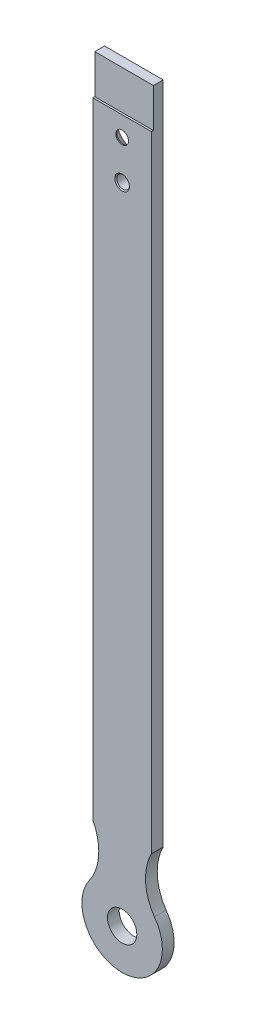
ISO-10303-21;
HEADER;
FILE_DESCRIPTION(('STEP AP214'),'2;1');
FILE_NAME('part.step','',(''),(''),'','','');
FILE_SCHEMA(('AUTOMOTIVE_DESIGN { 1 0 10303 214 1 1 1 1 }'));
ENDSEC;
DATA;
#1=APPLICATION_CONTEXT('core data for automotive mechanical design processes');
#2=APPLICATION_PROTOCOL_DEFINITION('international standard','automotive_design',2000,#1);
#3=PRODUCT_CONTEXT('',#1,'mechanical');
#4=PRODUCT('Part','Part','',(#3));
#5=PRODUCT_RELATED_PRODUCT_CATEGORY('part','',(#4));
#6=PRODUCT_DEFINITION_FORMATION('','',#4);
#7=PRODUCT_DEFINITION_CONTEXT('part definition',#1,'design');
#8=PRODUCT_DEFINITION('design','',#6,#7);
#9=PRODUCT_DEFINITION_SHAPE('','',#8);
#10=(LENGTH_UNIT() NAMED_UNIT(*) SI_UNIT(.MILLI.,.METRE.));
#11=(NAMED_UNIT(*) PLANE_ANGLE_UNIT() SI_UNIT($,.RADIAN.));
#12=(NAMED_UNIT(*) SI_UNIT($,.STERADIAN.) SOLID_ANGLE_UNIT());
#13=UNCERTAINTY_MEASURE_WITH_UNIT(LENGTH_MEASURE(1.E-05),#10,'distance_accuracy_value','');
#14=(GEOMETRIC_REPRESENTATION_CONTEXT(3) GLOBAL_UNCERTAINTY_ASSIGNED_CONTEXT((#13)) GLOBAL_UNIT_ASSIGNED_CONTEXT((#10,
#11,#12)) REPRESENTATION_CONTEXT('',''));
#15=CARTESIAN_POINT('',(0.,0.,0.));
#16=DIRECTION('',(0.,0.,1.));
#17=DIRECTION('',(1.,0.,0.));
#18=AXIS2_PLACEMENT_3D('',#15,#16,#17);
#19=CARTESIAN_POINT('',(38.582625391415,47.7587561776277,6.));
#20=DIRECTION('',(0.,0.,-1.));
#21=DIRECTION('',(-1.,0.,0.));
#22=AXIS2_PLACEMENT_3D('',#19,#20,#21);
#23=PLANE('',#22);
#24=CARTESIAN_POINT('',(0.,350.,6.));
#25=DIRECTION('',(0.,0.,-1.));
#26=DIRECTION('',(-1.,0.,0.));
#27=AXIS2_PLACEMENT_3D('',#24,#25,#26);
#28=CIRCLE('',#27,3.75000000000003);
#29=CARTESIAN_POINT('',(-3.75000000000004,350.,6.));
#30=VERTEX_POINT('',#29);
#31=EDGE_CURVE('E11',#30,#30,#28,.T.);
#32=ORIENTED_EDGE('',*,*,#31,.T.);
#33=EDGE_LOOP('',(#32));
#34=FACE_BOUND('',#33,.T.);
#35=DIRECTION('',(0.,1.,0.));
#36=VECTOR('',#35,1.);
#37=CARTESIAN_POINT('',(15.,60.1261643945457,6.));
#38=LINE('',#37,#36);
#39=CARTESIAN_POINT('',(15.,60.1261643945457,6.));
#40=VERTEX_POINT('',#39);
#41=CARTESIAN_POINT('',(15.,380.056352187278,6.));
#42=VERTEX_POINT('',#41);
#43=EDGE_CURVE('E127',#40,#42,#38,.T.);
#44=ORIENTED_EDGE('',*,*,#43,.T.);
#45=DIRECTION('',(-1.,0.,0.));
#46=VECTOR('',#45,1.);
#47=CARTESIAN_POINT('',(20.5785038712378,380.056352187278,6.));
#48=LINE('',#47,#46);
#49=CARTESIAN_POINT('',(-15.,380.056352187278,6.));
#50=VERTEX_POINT('',#49);
#51=EDGE_CURVE('E215',#42,#50,#48,.T.);
#52=ORIENTED_EDGE('',*,*,#51,.T.);
#53=DIRECTION('',(0.,-1.,0.));
#54=VECTOR('',#53,1.);
#55=CARTESIAN_POINT('',(-15.,60.1261643945457,6.));
#56=LINE('',#55,#54);
#57=CARTESIAN_POINT('',(-15.,60.1261643945457,6.));
#58=VERTEX_POINT('',#57);
#59=EDGE_CURVE('E94',#50,#58,#56,.T.);
#60=ORIENTED_EDGE('',*,*,#59,.T.);
#61=CARTESIAN_POINT('',(-38.582625391415,47.7587561776277,6.));
#62=DIRECTION('',(0.,0.,-1.));
#63=DIRECTION('',(1.,0.,0.));
#64=AXIS2_PLACEMENT_3D('',#61,#62,#63);
#65=CIRCLE('',#64,26.6288003176205);
#66=CARTESIAN_POINT('',(-16.5120693771721,32.8596433322979,6.));
#67=VERTEX_POINT('',#66);
#68=EDGE_CURVE('E198',#58,#67,#65,.T.);
#69=ORIENTED_EDGE('',*,*,#68,.T.);
#70=CARTESIAN_POINT('',(0.,20.5785038712379,6.));
#71=DIRECTION('',(0.,0.,1.));
#72=DIRECTION('',(1.,0.,0.));
#73=AXIS2_PLACEMENT_3D('',#70,#71,#72);
#74=CIRCLE('',#73,20.5785038712379);
#75=CARTESIAN_POINT('',(16.5120693771721,32.8596433322979,6.));
#76=VERTEX_POINT('',#75);
#77=EDGE_CURVE('E200',#67,#76,#74,.T.);
#78=ORIENTED_EDGE('',*,*,#77,.T.);
#79=CARTESIAN_POINT('',(38.582625391415,47.7587561776277,6.));
#80=DIRECTION('',(0.,0.,-1.));
#81=DIRECTION('',(-1.,0.,0.));
#82=AXIS2_PLACEMENT_3D('',#79,#80,#81);
#83=CIRCLE('',#82,26.6288003176205);
#84=EDGE_CURVE('E59',#76,#40,#83,.T.);
#85=ORIENTED_EDGE('',*,*,#84,.T.);
#86=EDGE_LOOP('',(#44,#52,#60,#69,#78,#85));
#87=FACE_BOUND('',#86,.T.);
#88=CARTESIAN_POINT('',(0.,20.5785038712379,6.));
#89=DIRECTION('',(0.,0.,1.));
#90=DIRECTION('',(1.,0.,0.));
#91=AXIS2_PLACEMENT_3D('',#88,#89,#90);
#92=CIRCLE('',#91,7.5);
#93=CARTESIAN_POINT('',(7.49999999999999,20.5785038712379,6.));
#94=VERTEX_POINT('',#93);
#95=EDGE_CURVE('E185',#94,#94,#92,.T.);
#96=ORIENTED_EDGE('',*,*,#95,.F.);
#97=EDGE_LOOP('',(#96));
#98=FACE_BOUND('',#97,.T.);
#99=CARTESIAN_POINT('',(0.,370.,6.));
#100=DIRECTION('',(0.,0.,1.));
#101=DIRECTION('',(1.,0.,0.));
#102=AXIS2_PLACEMENT_3D('',#99,#100,#101);
#103=CIRCLE('',#102,3.25);
#104=CARTESIAN_POINT('',(3.25,370.,6.));
#105=VERTEX_POINT('',#104);
#106=EDGE_CURVE('E360',#105,#105,#103,.T.);
#107=ORIENTED_EDGE('',*,*,#106,.F.);
#108=EDGE_LOOP('',(#107));
#109=FACE_BOUND('',#108,.T.);
#110=ADVANCED_FACE('F35',(#34,#87,#98,#109),#23,.F.);
#111=CARTESIAN_POINT('',(38.582625391415,47.7587561776277,0.));
#112=DIRECTION('',(0.,0.,-1.));
#113=DIRECTION('',(-1.,0.,0.));
#114=AXIS2_PLACEMENT_3D('',#111,#112,#113);
#115=PLANE('',#114);
#116=CARTESIAN_POINT('',(0.,350.,0.));
#117=DIRECTION('',(0.,0.,-1.));
#118=DIRECTION('',(-1.,0.,0.));
#119=AXIS2_PLACEMENT_3D('',#116,#117,#118);
#120=CIRCLE('',#119,3.74999999999998);
#121=CARTESIAN_POINT('',(-3.74999999999998,350.,0.));
#122=VERTEX_POINT('',#121);
#123=EDGE_CURVE('E153',#122,#122,#120,.F.);
#124=ORIENTED_EDGE('',*,*,#123,.T.);
#125=EDGE_LOOP('',(#124));
#126=FACE_BOUND('',#125,.T.);
#127=CARTESIAN_POINT('',(0.,370.,0.));
#128=DIRECTION('',(0.,0.,-1.));
#129=DIRECTION('',(-1.,0.,0.));
#130=AXIS2_PLACEMENT_3D('',#127,#128,#129);
#131=CIRCLE('',#130,8.74999999999998);
#132=CARTESIAN_POINT('',(-8.74999999999999,370.,0.));
#133=VERTEX_POINT('',#132);
#134=EDGE_CURVE('E147',#133,#133,#131,.F.);
#135=ORIENTED_EDGE('',*,*,#134,.T.);
#136=EDGE_LOOP('',(#135));
#137=FACE_BOUND('',#136,.T.);
#138=CARTESIAN_POINT('',(0.,20.5785038712379,0.));
#139=DIRECTION('',(0.,0.,1.));
#140=DIRECTION('',(1.,0.,0.));
#141=AXIS2_PLACEMENT_3D('',#138,#139,#140);
#142=CIRCLE('',#141,7.5);
#143=CARTESIAN_POINT('',(7.49999999999999,20.5785038712379,0.));
#144=VERTEX_POINT('',#143);
#145=EDGE_CURVE('E179',#144,#144,#142,.T.);
#146=ORIENTED_EDGE('',*,*,#145,.T.);
#147=EDGE_LOOP('',(#146));
#148=FACE_BOUND('',#147,.T.);
#149=DIRECTION('',(0.,-1.,0.));
#150=VECTOR('',#149,1.);
#151=CARTESIAN_POINT('',(-15.,60.1261643945457,0.));
#152=LINE('',#151,#150);
#153=CARTESIAN_POINT('',(-15.,400.,0.));
#154=VERTEX_POINT('',#153);
#155=CARTESIAN_POINT('',(-15.,60.1261643945457,0.));
#156=VERTEX_POINT('',#155);
#157=EDGE_CURVE('E180',#154,#156,#152,.T.);
#158=ORIENTED_EDGE('',*,*,#157,.F.);
#159=DIRECTION('',(-1.,0.,0.));
#160=VECTOR('',#159,1.);
#161=CARTESIAN_POINT('',(15.,400.,0.));
#162=LINE('',#161,#160);
#163=CARTESIAN_POINT('',(15.,400.,0.));
#164=VERTEX_POINT('',#163);
#165=EDGE_CURVE('E124',#164,#154,#162,.T.);
#166=ORIENTED_EDGE('',*,*,#165,.F.);
#167=DIRECTION('',(0.,1.,0.));
#168=VECTOR('',#167,1.);
#169=CARTESIAN_POINT('',(15.,60.1261643945457,0.));
#170=LINE('',#169,#168);
#171=CARTESIAN_POINT('',(15.,60.1261643945457,0.));
#172=VERTEX_POINT('',#171);
#173=EDGE_CURVE('E195',#172,#164,#170,.T.);
#174=ORIENTED_EDGE('',*,*,#173,.F.);
#175=CARTESIAN_POINT('',(38.582625391415,47.7587561776277,0.));
#176=DIRECTION('',(0.,0.,-1.));
#177=DIRECTION('',(-1.,0.,0.));
#178=AXIS2_PLACEMENT_3D('',#175,#176,#177);
#179=CIRCLE('',#178,26.6288003176205);
#180=CARTESIAN_POINT('',(16.5120693771721,32.8596433322979,0.));
#181=VERTEX_POINT('',#180);
#182=EDGE_CURVE('E194',#181,#172,#179,.T.);
#183=ORIENTED_EDGE('',*,*,#182,.F.);
#184=CARTESIAN_POINT('',(0.,20.5785038712379,0.));
#185=DIRECTION('',(0.,0.,1.));
#186=DIRECTION('',(1.,0.,0.));
#187=AXIS2_PLACEMENT_3D('',#184,#185,#186);
#188=CIRCLE('',#187,20.5785038712379);
#189=CARTESIAN_POINT('',(-16.5120693771721,32.8596433322979,0.));
#190=VERTEX_POINT('',#189);
#191=EDGE_CURVE('E187',#190,#181,#188,.T.);
#192=ORIENTED_EDGE('',*,*,#191,.F.);
#193=CARTESIAN_POINT('',(-38.582625391415,47.7587561776277,0.));
#194=DIRECTION('',(0.,0.,-1.));
#195=DIRECTION('',(1.,0.,0.));
#196=AXIS2_PLACEMENT_3D('',#193,#194,#195);
#197=CIRCLE('',#196,26.6288003176205);
#198=EDGE_CURVE('E183',#156,#190,#197,.T.);
#199=ORIENTED_EDGE('',*,*,#198,.F.);
#200=EDGE_LOOP('',(#158,#166,#174,#183,#192,#199));
#201=FACE_BOUND('',#200,.T.);
#202=ADVANCED_FACE('F170',(#126,#137,#148,#201),#115,.T.);
#203=CARTESIAN_POINT('',(-15.,60.1261643945457,6.));
#204=DIRECTION('',(1.,0.,0.));
#205=DIRECTION('',(0.,1.,0.));
#206=AXIS2_PLACEMENT_3D('',#203,#204,#205);
#207=PLANE('',#206);
#208=ORIENTED_EDGE('',*,*,#59,.F.);
#209=DIRECTION('',(0.,0.,1.));
#210=VECTOR('',#209,1.);
#211=CARTESIAN_POINT('',(-15.,380.056352187278,5.));
#212=LINE('',#211,#210);
#213=CARTESIAN_POINT('',(-15.,380.056352187278,5.));
#214=VERTEX_POINT('',#213);
#215=EDGE_CURVE('E120',#214,#50,#212,.T.);
#216=ORIENTED_EDGE('',*,*,#215,.F.);
#217=DIRECTION('',(0.,-1.,0.));
#218=VECTOR('',#217,1.);
#219=CARTESIAN_POINT('',(-15.,400.,5.));
#220=LINE('',#219,#218);
#221=CARTESIAN_POINT('',(-15.,400.,5.));
#222=VERTEX_POINT('',#221);
#223=EDGE_CURVE('E112',#222,#214,#220,.T.);
#224=ORIENTED_EDGE('',*,*,#223,.F.);
#225=DIRECTION('',(0.,0.,-1.));
#226=VECTOR('',#225,1.);
#227=CARTESIAN_POINT('',(-15.,400.,6.));
#228=LINE('',#227,#226);
#229=EDGE_CURVE('E87',#222,#154,#228,.T.);
#230=ORIENTED_EDGE('',*,*,#229,.T.);
#231=ORIENTED_EDGE('',*,*,#157,.T.);
#232=DIRECTION('',(0.,0.,-1.));
#233=VECTOR('',#232,1.);
#234=CARTESIAN_POINT('',(-15.,60.1261643945457,6.));
#235=LINE('',#234,#233);
#236=EDGE_CURVE('E117',#58,#156,#235,.T.);
#237=ORIENTED_EDGE('',*,*,#236,.F.);
#238=EDGE_LOOP('',(#208,#216,#224,#230,#231,#237));
#239=FACE_BOUND('',#238,.T.);
#240=ADVANCED_FACE('F119',(#239),#207,.F.);
#241=CARTESIAN_POINT('',(-38.582625391415,47.7587561776277,6.));
#242=DIRECTION('',(0.,0.,-1.));
#243=DIRECTION('',(-1.,0.,0.));
#244=AXIS2_PLACEMENT_3D('',#241,#242,#243);
#245=CYLINDRICAL_SURFACE('',#244,26.6288003176205);
#246=ORIENTED_EDGE('',*,*,#198,.T.);
#247=DIRECTION('',(0.,0.,-1.));
#248=VECTOR('',#247,1.);
#249=CARTESIAN_POINT('',(-16.5120693771721,32.8596433322979,6.));
#250=LINE('',#249,#248);
#251=EDGE_CURVE('E140',#67,#190,#250,.T.);
#252=ORIENTED_EDGE('',*,*,#251,.F.);
#253=ORIENTED_EDGE('',*,*,#68,.F.);
#254=ORIENTED_EDGE('',*,*,#236,.T.);
#255=EDGE_LOOP('',(#246,#252,#253,#254));
#256=FACE_BOUND('',#255,.T.);
#257=ADVANCED_FACE('F220',(#256),#245,.F.);
#258=CARTESIAN_POINT('',(0.,20.5785038712379,6.));
#259=DIRECTION('',(0.,0.,-1.));
#260=DIRECTION('',(-1.,0.,0.));
#261=AXIS2_PLACEMENT_3D('',#258,#259,#260);
#262=CYLINDRICAL_SURFACE('',#261,20.5785038712379);
#263=ORIENTED_EDGE('',*,*,#191,.T.);
#264=DIRECTION('',(0.,0.,-1.));
#265=VECTOR('',#264,1.);
#266=CARTESIAN_POINT('',(16.5120693771721,32.8596433322979,6.));
#267=LINE('',#266,#265);
#268=EDGE_CURVE('E137',#76,#181,#267,.T.);
#269=ORIENTED_EDGE('',*,*,#268,.F.);
#270=ORIENTED_EDGE('',*,*,#77,.F.);
#271=ORIENTED_EDGE('',*,*,#251,.T.);
#272=EDGE_LOOP('',(#263,#269,#270,#271));
#273=FACE_BOUND('',#272,.T.);
#274=ADVANCED_FACE('F209',(#273),#262,.T.);
#275=CARTESIAN_POINT('',(38.582625391415,47.7587561776277,6.));
#276=DIRECTION('',(0.,0.,-1.));
#277=DIRECTION('',(-1.,0.,0.));
#278=AXIS2_PLACEMENT_3D('',#275,#276,#277);
#279=CYLINDRICAL_SURFACE('',#278,26.6288003176205);
#280=ORIENTED_EDGE('',*,*,#182,.T.);
#281=DIRECTION('',(0.,0.,-1.));
#282=VECTOR('',#281,1.);
#283=CARTESIAN_POINT('',(15.,60.1261643945457,6.));
#284=LINE('',#283,#282);
#285=EDGE_CURVE('E129',#40,#172,#284,.T.);
#286=ORIENTED_EDGE('',*,*,#285,.F.);
#287=ORIENTED_EDGE('',*,*,#84,.F.);
#288=ORIENTED_EDGE('',*,*,#268,.T.);
#289=EDGE_LOOP('',(#280,#286,#287,#288));
#290=FACE_BOUND('',#289,.T.);
#291=ADVANCED_FACE('F212',(#290),#279,.F.);
#292=CARTESIAN_POINT('',(15.,60.1261643945457,6.));
#293=DIRECTION('',(-1.,0.,0.));
#294=DIRECTION('',(0.,-1.,0.));
#295=AXIS2_PLACEMENT_3D('',#292,#293,#294);
#296=PLANE('',#295);
#297=DIRECTION('',(0.,-1.,0.));
#298=VECTOR('',#297,1.);
#299=CARTESIAN_POINT('',(15.,60.1261643945457,5.00000000000003));
#300=LINE('',#299,#298);
#301=CARTESIAN_POINT('',(15.,400.,5.));
#302=VERTEX_POINT('',#301);
#303=CARTESIAN_POINT('',(15.,380.056352187278,5.));
#304=VERTEX_POINT('',#303);
#305=EDGE_CURVE('E50',#302,#304,#300,.T.);
#306=ORIENTED_EDGE('',*,*,#305,.T.);
#307=DIRECTION('',(0.,0.,1.));
#308=VECTOR('',#307,1.);
#309=CARTESIAN_POINT('',(15.,380.056352187278,6.));
#310=LINE('',#309,#308);
#311=EDGE_CURVE('E116',#304,#42,#310,.T.);
#312=ORIENTED_EDGE('',*,*,#311,.T.);
#313=ORIENTED_EDGE('',*,*,#43,.F.);
#314=ORIENTED_EDGE('',*,*,#285,.T.);
#315=ORIENTED_EDGE('',*,*,#173,.T.);
#316=DIRECTION('',(0.,0.,-1.));
#317=VECTOR('',#316,1.);
#318=CARTESIAN_POINT('',(15.,400.,6.));
#319=LINE('',#318,#317);
#320=EDGE_CURVE('E126',#302,#164,#319,.T.);
#321=ORIENTED_EDGE('',*,*,#320,.F.);
#322=EDGE_LOOP('',(#306,#312,#313,#314,#315,#321));
#323=FACE_BOUND('',#322,.T.);
#324=ADVANCED_FACE('F214',(#323),#296,.F.);
#325=CARTESIAN_POINT('',(15.,400.,6.));
#326=DIRECTION('',(0.,-1.,0.));
#327=DIRECTION('',(0.,0.,-1.));
#328=AXIS2_PLACEMENT_3D('',#325,#326,#327);
#329=PLANE('',#328);
#330=ORIENTED_EDGE('',*,*,#229,.F.);
#331=DIRECTION('',(1.,0.,0.));
#332=VECTOR('',#331,1.);
#333=CARTESIAN_POINT('',(15.,400.,5.));
#334=LINE('',#333,#332);
#335=EDGE_CURVE('E110',#222,#302,#334,.T.);
#336=ORIENTED_EDGE('',*,*,#335,.T.);
#337=ORIENTED_EDGE('',*,*,#320,.T.);
#338=ORIENTED_EDGE('',*,*,#165,.T.);
#339=EDGE_LOOP('',(#330,#336,#337,#338));
#340=FACE_BOUND('',#339,.T.);
#341=ADVANCED_FACE('F122',(#340),#329,.F.);
#342=CARTESIAN_POINT('',(0.,350.,6.));
#343=DIRECTION('',(0.,0.,-1.));
#344=DIRECTION('',(-1.,0.,0.));
#345=AXIS2_PLACEMENT_3D('',#342,#343,#344);
#346=CYLINDRICAL_SURFACE('',#345,3.25);
#347=CARTESIAN_POINT('',(0.,350.,0.50000000000002));
#348=DIRECTION('',(0.,0.,-1.));
#349=DIRECTION('',(-1.,0.,0.));
#350=AXIS2_PLACEMENT_3D('',#347,#348,#349);
#351=CIRCLE('',#350,3.25);
#352=CARTESIAN_POINT('',(-3.25,350.,0.50000000000002));
#353=VERTEX_POINT('',#352);
#354=EDGE_CURVE('E43',#353,#353,#351,.T.);
#355=ORIENTED_EDGE('',*,*,#354,.T.);
#356=EDGE_LOOP('',(#355));
#357=FACE_BOUND('',#356,.T.);
#358=CARTESIAN_POINT('',(0.,350.,5.49999999999996));
#359=DIRECTION('',(0.,0.,-1.));
#360=DIRECTION('',(-1.,0.,0.));
#361=AXIS2_PLACEMENT_3D('',#358,#359,#360);
#362=CIRCLE('',#361,3.25);
#363=CARTESIAN_POINT('',(-3.25,350.,5.49999999999996));
#364=VERTEX_POINT('',#363);
#365=EDGE_CURVE('E156',#364,#364,#362,.F.);
#366=ORIENTED_EDGE('',*,*,#365,.T.);
#367=EDGE_LOOP('',(#366));
#368=FACE_BOUND('',#367,.T.);
#369=ADVANCED_FACE('F161',(#357,#368),#346,.F.);
#370=CARTESIAN_POINT('',(0.,20.5785038712379,6.));
#371=DIRECTION('',(0.,0.,-1.));
#372=DIRECTION('',(-1.,0.,0.));
#373=AXIS2_PLACEMENT_3D('',#370,#371,#372);
#374=CYLINDRICAL_SURFACE('',#373,7.5);
#375=ORIENTED_EDGE('',*,*,#95,.T.);
#376=EDGE_LOOP('',(#375));
#377=FACE_BOUND('',#376,.T.);
#378=ORIENTED_EDGE('',*,*,#145,.F.);
#379=EDGE_LOOP('',(#378));
#380=FACE_BOUND('',#379,.T.);
#381=ADVANCED_FACE('F263',(#377,#380),#374,.F.);
#382=CARTESIAN_POINT('',(0.,370.,6.));
#383=DIRECTION('',(0.,0.,-1.));
#384=DIRECTION('',(-1.,0.,0.));
#385=AXIS2_PLACEMENT_3D('',#382,#383,#384);
#386=CYLINDRICAL_SURFACE('',#385,3.25);
#387=CARTESIAN_POINT('',(0.,370.,5.50000000000002));
#388=DIRECTION('',(0.,0.,-1.));
#389=DIRECTION('',(-1.,0.,0.));
#390=AXIS2_PLACEMENT_3D('',#387,#388,#389);
#391=CIRCLE('',#390,3.25);
#392=CARTESIAN_POINT('',(-3.25,370.,5.50000000000002));
#393=VERTEX_POINT('',#392);
#394=EDGE_CURVE('E150',#393,#393,#391,.T.);
#395=ORIENTED_EDGE('',*,*,#394,.T.);
#396=EDGE_LOOP('',(#395));
#397=FACE_BOUND('',#396,.T.);
#398=ORIENTED_EDGE('',*,*,#106,.T.);
#399=EDGE_LOOP('',(#398));
#400=FACE_BOUND('',#399,.T.);
#401=ADVANCED_FACE('F270',(#397,#400),#386,.F.);
#402=CARTESIAN_POINT('',(20.5785038712378,380.056352187278,5.));
#403=DIRECTION('',(0.,-1.,0.));
#404=DIRECTION('',(1.,0.,0.));
#405=AXIS2_PLACEMENT_3D('',#402,#403,#404);
#406=PLANE('',#405);
#407=DIRECTION('',(-1.,0.,0.));
#408=VECTOR('',#407,1.);
#409=CARTESIAN_POINT('',(20.5785038712378,380.056352187278,5.));
#410=LINE('',#409,#408);
#411=EDGE_CURVE('E217',#304,#214,#410,.T.);
#412=ORIENTED_EDGE('',*,*,#411,.T.);
#413=ORIENTED_EDGE('',*,*,#215,.T.);
#414=ORIENTED_EDGE('',*,*,#51,.F.);
#415=ORIENTED_EDGE('',*,*,#311,.F.);
#416=EDGE_LOOP('',(#412,#413,#414,#415));
#417=FACE_BOUND('',#416,.T.);
#418=ADVANCED_FACE('F277',(#417),#406,.F.);
#419=CARTESIAN_POINT('',(20.5785038712378,400.,5.));
#420=DIRECTION('',(0.,0.,-1.));
#421=DIRECTION('',(0.,1.,0.));
#422=AXIS2_PLACEMENT_3D('',#419,#420,#421);
#423=PLANE('',#422);
#424=ORIENTED_EDGE('',*,*,#335,.F.);
#425=ORIENTED_EDGE('',*,*,#223,.T.);
#426=ORIENTED_EDGE('',*,*,#411,.F.);
#427=ORIENTED_EDGE('',*,*,#305,.F.);
#428=EDGE_LOOP('',(#424,#425,#426,#427));
#429=FACE_BOUND('',#428,.T.);
#430=ADVANCED_FACE('F111',(#429),#423,.F.);
#431=CARTESIAN_POINT('',(0.,370.,0.));
#432=DIRECTION('',(0.,0.,-1.));
#433=DIRECTION('',(-1.,0.,0.));
#434=AXIS2_PLACEMENT_3D('',#431,#432,#433);
#435=CONICAL_SURFACE('',#434,8.74999999999998,0.785398163397444);
#436=ORIENTED_EDGE('',*,*,#394,.F.);
#437=EDGE_LOOP('',(#436));
#438=FACE_BOUND('',#437,.T.);
#439=ORIENTED_EDGE('',*,*,#134,.F.);
#440=EDGE_LOOP('',(#439));
#441=FACE_BOUND('',#440,.T.);
#442=ADVANCED_FACE('F167',(#438,#441),#435,.F.);
#443=CARTESIAN_POINT('',(0.,350.,0.));
#444=DIRECTION('',(0.,0.,-1.));
#445=DIRECTION('',(-1.,0.,0.));
#446=AXIS2_PLACEMENT_3D('',#443,#444,#445);
#447=CONICAL_SURFACE('',#446,3.74999999999998,0.785398163397404);
#448=ORIENTED_EDGE('',*,*,#354,.F.);
#449=EDGE_LOOP('',(#448));
#450=FACE_BOUND('',#449,.T.);
#451=ORIENTED_EDGE('',*,*,#123,.F.);
#452=EDGE_LOOP('',(#451));
#453=FACE_BOUND('',#452,.T.);
#454=ADVANCED_FACE('F164',(#450,#453),#447,.F.);
#455=CARTESIAN_POINT('',(0.,350.,5.49999999999996));
#456=DIRECTION('',(0.,0.,1.));
#457=DIRECTION('',(1.,0.,0.));
#458=AXIS2_PLACEMENT_3D('',#455,#456,#457);
#459=CONICAL_SURFACE('',#458,3.25,0.785398163397437);
#460=ORIENTED_EDGE('',*,*,#31,.F.);
#461=EDGE_LOOP('',(#460));
#462=FACE_BOUND('',#461,.T.);
#463=ORIENTED_EDGE('',*,*,#365,.F.);
#464=EDGE_LOOP('',(#463));
#465=FACE_BOUND('',#464,.T.);
#466=ADVANCED_FACE('F37',(#462,#465),#459,.F.);
#467=CLOSED_SHELL('',(#110,#202,#240,#257,#274,#291,#324,#341,#369,#381,#401,#418,#430,#442,
#454,#466));
#468=MANIFOLD_SOLID_BREP('B2',#467);
#469=ADVANCED_BREP_SHAPE_REPRESENTATION('',(#18,#468),#14);
#470=SHAPE_DEFINITION_REPRESENTATION(#9,#469);
ENDSEC;
END-ISO-10303-21;
